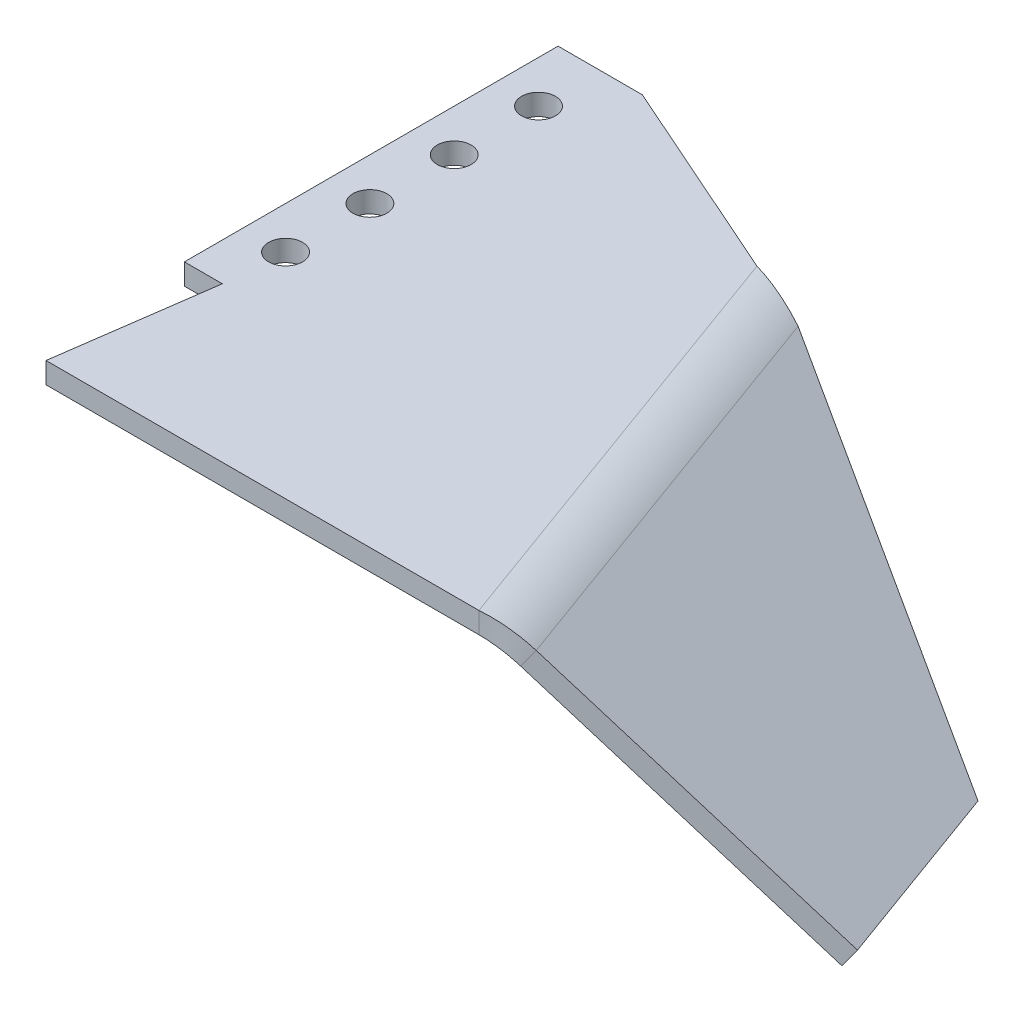
ISO-10303-21;
HEADER;
FILE_DESCRIPTION(('STEP AP214'),'2;1');
FILE_NAME('part.step','',(''),(''),'','','');
FILE_SCHEMA(('AUTOMOTIVE_DESIGN { 1 0 10303 214 1 1 1 1 }'));
ENDSEC;
DATA;
#1=APPLICATION_CONTEXT('core data for automotive mechanical design processes');
#2=APPLICATION_PROTOCOL_DEFINITION('international standard','automotive_design',2000,#1);
#3=PRODUCT_CONTEXT('',#1,'mechanical');
#4=PRODUCT('Part','Part','',(#3));
#5=PRODUCT_RELATED_PRODUCT_CATEGORY('part','',(#4));
#6=PRODUCT_DEFINITION_FORMATION('','',#4);
#7=PRODUCT_DEFINITION_CONTEXT('part definition',#1,'design');
#8=PRODUCT_DEFINITION('design','',#6,#7);
#9=PRODUCT_DEFINITION_SHAPE('','',#8);
#10=(LENGTH_UNIT() NAMED_UNIT(*) SI_UNIT(.MILLI.,.METRE.));
#11=(NAMED_UNIT(*) PLANE_ANGLE_UNIT() SI_UNIT($,.RADIAN.));
#12=(NAMED_UNIT(*) SI_UNIT($,.STERADIAN.) SOLID_ANGLE_UNIT());
#13=UNCERTAINTY_MEASURE_WITH_UNIT(LENGTH_MEASURE(1.E-05),#10,'distance_accuracy_value','');
#14=(GEOMETRIC_REPRESENTATION_CONTEXT(3) GLOBAL_UNCERTAINTY_ASSIGNED_CONTEXT((#13)) GLOBAL_UNIT_ASSIGNED_CONTEXT((#10,
#11,#12)) REPRESENTATION_CONTEXT('',''));
#15=CARTESIAN_POINT('',(0.,0.,0.));
#16=DIRECTION('',(0.,0.,1.));
#17=DIRECTION('',(1.,0.,0.));
#18=AXIS2_PLACEMENT_3D('',#15,#16,#17);
#19=CARTESIAN_POINT('',(86.3212998025083,-26.5217748538847,26.1180665960054));
#20=DIRECTION('',(-0.207730764031655,0.354974468036249,0.911504830879797));
#21=DIRECTION('',(0.816298053583275,-0.450536408494973,0.361489187025849));
#22=AXIS2_PLACEMENT_3D('',#19,#20,#21);
#23=PLANE('',#22);
#24=DIRECTION('',(-0.538985544695757,-0.819152044288991,0.19617469496901));
#25=VECTOR('',#24,1.);
#26=CARTESIAN_POINT('',(44.2655111862627,-3.31007677814735,7.49409368576421));
#27=LINE('',#26,#25);
#28=CARTESIAN_POINT('',(45.9767902906718,-0.709269037529801,6.87123902923758));
#29=VERTEX_POINT('',#28);
#30=CARTESIAN_POINT('',(44.2655111862627,-3.31007677814735,7.49409368576421));
#31=VERTEX_POINT('',#30);
#32=EDGE_CURVE('E11',#29,#31,#27,.T.);
#33=ORIENTED_EDGE('',*,*,#32,.F.);
#34=DIRECTION('',(0.816298053583275,-0.450536408494973,0.361489187025849));
#35=VECTOR('',#34,1.);
#36=CARTESIAN_POINT('',(88.0325789069173,-23.9209671132671,25.4952119394788));
#37=LINE('',#36,#35);
#38=CARTESIAN_POINT('',(94.6081225950128,-27.5501829666332,28.4071237486868));
#39=VERTEX_POINT('',#38);
#40=EDGE_CURVE('E105',#29,#39,#37,.T.);
#41=ORIENTED_EDGE('',*,*,#40,.T.);
#42=DIRECTION('',(-0.538985544695757,-0.819152044288991,0.19617469496901));
#43=VECTOR('',#42,1.);
#44=CARTESIAN_POINT('',(92.8968434906037,-30.1509907072508,29.0299784052133));
#45=LINE('',#44,#43);
#46=CARTESIAN_POINT('',(92.8968434906037,-30.1509907072508,29.0299784052133));
#47=VERTEX_POINT('',#46);
#48=EDGE_CURVE('E56',#39,#47,#45,.T.);
#49=ORIENTED_EDGE('',*,*,#48,.T.);
#50=DIRECTION('',(0.816298053583275,-0.450536408494973,0.361489187025849));
#51=VECTOR('',#50,1.);
#52=CARTESIAN_POINT('',(86.3212998025083,-26.5217748538847,26.1180665960054));
#53=LINE('',#52,#51);
#54=EDGE_CURVE('E108',#31,#47,#53,.T.);
#55=ORIENTED_EDGE('',*,*,#54,.F.);
#56=EDGE_LOOP('',(#33,#41,#49,#55));
#57=FACE_BOUND('',#56,.T.);
#58=ADVANCED_FACE('F45',(#57),#23,.F.);
#59=CARTESIAN_POINT('',(92.8968434906038,-30.1509907072508,29.0299784052133));
#60=DIRECTION('',(-0.769751131320058,0.573576436351047,0.280166499593233));
#61=DIRECTION('',(0.342020143325666,0.,0.93969262078591));
#62=AXIS2_PLACEMENT_3D('',#59,#60,#61);
#63=PLANE('',#62);
#64=ORIENTED_EDGE('',*,*,#48,.F.);
#65=DIRECTION('',(0.342020143325666,0.,0.93969262078591));
#66=VECTOR('',#65,1.);
#67=CARTESIAN_POINT('',(94.6081225950128,-27.5501829666332,28.4071237486867));
#68=LINE('',#67,#66);
#69=CARTESIAN_POINT('',(104.992448710341,-27.5501829666332,56.9378252668029));
#70=VERTEX_POINT('',#69);
#71=EDGE_CURVE('E134',#39,#70,#68,.T.);
#72=ORIENTED_EDGE('',*,*,#71,.T.);
#73=DIRECTION('',(-0.538985544695757,-0.819152044288991,0.19617469496901));
#74=VECTOR('',#73,1.);
#75=CARTESIAN_POINT('',(103.281169605932,-30.1509907072508,57.5606799233295));
#76=LINE('',#75,#74);
#77=CARTESIAN_POINT('',(103.281169605932,-30.1509907072508,57.5606799233295));
#78=VERTEX_POINT('',#77);
#79=EDGE_CURVE('E188',#70,#78,#76,.T.);
#80=ORIENTED_EDGE('',*,*,#79,.T.);
#81=DIRECTION('',(0.342020143325666,0.,0.93969262078591));
#82=VECTOR('',#81,1.);
#83=CARTESIAN_POINT('',(92.8968434906038,-30.1509907072508,29.0299784052133));
#84=LINE('',#83,#82);
#85=EDGE_CURVE('E201',#47,#78,#84,.T.);
#86=ORIENTED_EDGE('',*,*,#85,.F.);
#87=EDGE_LOOP('',(#64,#72,#80,#86));
#88=FACE_BOUND('',#87,.T.);
#89=ADVANCED_FACE('F208',(#88),#63,.F.);
#90=CARTESIAN_POINT('',(72.0975437886997,-7.18391408226765,67.7862812544511));
#91=DIRECTION('',(-0.321598313483679,-0.0151285657140216,-0.946755328088462));
#92=DIRECTION('',(-0.778504404209425,0.573376887253579,0.25528383769821));
#93=AXIS2_PLACEMENT_3D('',#90,#91,#92);
#94=PLANE('',#93);
#95=ORIENTED_EDGE('',*,*,#79,.F.);
#96=DIRECTION('',(-0.778504404209425,0.573376887253579,0.25528383769821));
#97=VECTOR('',#96,1.);
#98=CARTESIAN_POINT('',(73.8088228931087,-4.58310634165011,67.1634265979245));
#99=LINE('',#98,#97);
#100=CARTESIAN_POINT('',(68.5491072165774,-0.709269037529816,68.8881700879371));
#101=VERTEX_POINT('',#100);
#102=EDGE_CURVE('E276',#70,#101,#99,.T.);
#103=ORIENTED_EDGE('',*,*,#102,.T.);
#104=DIRECTION('',(-0.538985544695758,-0.819152044288991,0.19617469496901));
#105=VECTOR('',#104,1.);
#106=CARTESIAN_POINT('',(66.8378281121683,-3.31007677814736,69.5110247444637));
#107=LINE('',#106,#105);
#108=CARTESIAN_POINT('',(66.8378281121683,-3.31007677814736,69.5110247444637));
#109=VERTEX_POINT('',#108);
#110=EDGE_CURVE('E184',#101,#109,#107,.T.);
#111=ORIENTED_EDGE('',*,*,#110,.T.);
#112=DIRECTION('',(-0.778504404209425,0.573376887253579,0.25528383769821));
#113=VECTOR('',#112,1.);
#114=CARTESIAN_POINT('',(72.0975437886997,-7.18391408226765,67.7862812544511));
#115=LINE('',#114,#113);
#116=EDGE_CURVE('E210',#78,#109,#115,.T.);
#117=ORIENTED_EDGE('',*,*,#116,.F.);
#118=EDGE_LOOP('',(#95,#103,#111,#117));
#119=FACE_BOUND('',#118,.T.);
#120=ADVANCED_FACE('F294',(#119),#94,.F.);
#121=CARTESIAN_POINT('',(68.9760457963346,-1.04111096718413,68.738685480414));
#122=CARTESIAN_POINT('',(68.3701994548696,-1.88039338658545,68.9591955152464));
#123=CARTESIAN_POINT('',(67.7643531134046,-2.71967580598677,69.1797055500787));
#124=CARTESIAN_POINT('',(67.1585067719396,-3.55895822538809,69.4002155849111));
#125=CARTESIAN_POINT('',(50.0480258859322,14.432366075766,75.6279213213985));
#126=CARTESIAN_POINT('',(51.0195145370008,12.3036272361188,75.2743283694821));
#127=CARTESIAN_POINT('',(51.9910031880693,10.1748883964717,74.9207354175658));
#128=CARTESIAN_POINT('',(52.9624918391378,8.04614955682449,74.5671424656494));
#129=CARTESIAN_POINT('',(31.6149473667552,-5.71041198986575,70.2248745829254));
#130=CARTESIAN_POINT('',(33.7981287007537,-6.16058599071027,69.4302615613444));
#131=CARTESIAN_POINT('',(35.9813100347523,-6.6107599915548,68.6356485397634));
#132=CARTESIAN_POINT('',(38.1644913687508,-7.06093399239932,67.8410355181823));
#133=CARTESIAN_POINT('',(50.5429672771576,-21.1838890328159,63.335638741941));
#134=CARTESIAN_POINT('',(51.1488136186226,-20.3446066134145,63.1151287071087));
#135=CARTESIAN_POINT('',(51.7546599600876,-19.5053241940132,62.8946186722763));
#136=CARTESIAN_POINT('',(52.3605063015526,-18.6660417746119,62.674108637444));
#137=CARTESIAN_POINT('',(69.47098718756,-36.657366075766,56.4464029009565));
#138=CARTESIAN_POINT('',(68.4994985364915,-34.5286272361188,56.7999958528729));
#139=CARTESIAN_POINT('',(67.528009885423,-32.3998883964717,57.1535888047893));
#140=CARTESIAN_POINT('',(66.5565212343544,-30.2711495568245,57.5071817567056));
#141=CARTESIAN_POINT('',(87.9040657067371,-16.5145880101343,61.8494496394296));
#142=CARTESIAN_POINT('',(85.7208843727385,-16.0644140092897,62.6440626610106));
#143=CARTESIAN_POINT('',(83.53770303874,-15.6142400084452,63.4386756825917));
#144=CARTESIAN_POINT('',(81.3545217047414,-15.1640660076007,64.2332887041727));
#145=CARTESIAN_POINT('',(68.9760457963346,-1.04111096718413,68.738685480414));
#146=CARTESIAN_POINT('',(68.3701994548696,-1.88039338658545,68.9591955152464));
#147=CARTESIAN_POINT('',(67.7643531134046,-2.71967580598677,69.1797055500787));
#148=CARTESIAN_POINT('',(67.1585067719396,-3.55895822538809,69.4002155849111));
#149=(BOUNDED_SURFACE() B_SPLINE_SURFACE(3,3,((#121,#122,#123,#124),(#125,#126,#127,#128),(#129,
#130,#131,#132),(#133,#134,#135,#136),(#137,#138,#139,#140),(#141,#142,#143,#144),(#145,#146,
#147,#148)),.UNSPECIFIED.,.T.,.F.,.F.) B_SPLINE_SURFACE_WITH_KNOTS((4,3,4),(4,4),(0.,0.5,1.),
(0.,1.),.UNSPECIFIED.) GEOMETRIC_REPRESENTATION_ITEM() RATIONAL_B_SPLINE_SURFACE(((1.,1.,1.,1.),
(0.333333333333333,0.333333333333333,0.333333333333333,0.333333333333333),(0.333333333333333,
0.333333333333333,0.333333333333333,0.333333333333333),(1.,1.,1.,1.),(0.333333333333333,
0.333333333333333,0.333333333333333,0.333333333333333),(0.333333333333333,0.333333333333333,
0.333333333333333,0.333333333333333),(1.,1.,1.,1.))) REPRESENTATION_ITEM('') SURFACE());
#150=CARTESIAN_POINT('',(59.7595065367461,-11.1125,66.0371621111775));
#151=DIRECTION('',(-0.0780293241779053,0.3242834139524,-0.9427362791384));
#152=DIRECTION('',(0.662262720111887,0.723688719628526,0.194120392108684));
#153=AXIS2_PLACEMENT_3D('',#150,#151,#152);
#154=ELLIPSE('',#153,13.9167417698394,12.7);
#155=CARTESIAN_POINT('',(61.3030326809593,1.5875,70.2779653387413));
#156=VERTEX_POINT('',#155);
#157=EDGE_CURVE('E123',#101,#156,#154,.F.);
#158=DIRECTION('',(0.,-1.,0.));
#159=VECTOR('',#158,1.);
#160=CARTESIAN_POINT('',(61.3030326809593,-1.5875,70.2779653387413));
#161=LINE('',#160,#159);
#162=CARTESIAN_POINT('',(61.3030326809593,-1.5875,70.2779653387413));
#163=VERTEX_POINT('',#162);
#164=EDGE_CURVE('E64',#156,#163,#161,.T.);
#165=CARTESIAN_POINT('',(59.7595065367461,-11.1125,66.0371621111775));
#166=DIRECTION('',(0.,0.406736643075798,-0.913545457642602));
#167=DIRECTION('',(0.666843674245813,0.680771913831372,0.303099184190116));
#168=AXIS2_PLACEMENT_3D('',#165,#166,#167);
#169=ELLIPSE('',#168,11.0955543569662,9.525);
#170=EDGE_CURVE('E206',#109,#163,#169,.F.);
#171=ORIENTED_EDGE('',*,*,#110,.F.);
#172=ORIENTED_EDGE('',*,*,#157,.T.);
#173=ORIENTED_EDGE('',*,*,#164,.T.);
#174=ORIENTED_EDGE('',*,*,#170,.F.);
#175=EDGE_LOOP('',(#171,#172,#173,#174));
#176=FACE_BOUND('',#175,.T.);
#177=ADVANCED_FACE('F297',(#176),#149,.T.);
#178=CARTESIAN_POINT('',(0.,-1.5875,70.2779653387413));
#179=DIRECTION('',(0.,0.,-1.));
#180=DIRECTION('',(-1.,0.,0.));
#181=AXIS2_PLACEMENT_3D('',#178,#179,#180);
#182=PLANE('',#181);
#183=ORIENTED_EDGE('',*,*,#164,.F.);
#184=DIRECTION('',(1.,0.,0.));
#185=VECTOR('',#184,1.);
#186=CARTESIAN_POINT('',(0.,1.5875,70.2779653387413));
#187=LINE('',#186,#185);
#188=CARTESIAN_POINT('',(-3.90791008722715,1.5875,70.2779653387413));
#189=VERTEX_POINT('',#188);
#190=EDGE_CURVE('E271',#156,#189,#187,.F.);
#191=ORIENTED_EDGE('',*,*,#190,.T.);
#192=DIRECTION('',(0.,-1.,0.));
#193=VECTOR('',#192,1.);
#194=CARTESIAN_POINT('',(-3.90791008722715,-1.5875,70.2779653387413));
#195=LINE('',#194,#193);
#196=CARTESIAN_POINT('',(-3.90791008722715,-1.5875,70.2779653387413));
#197=VERTEX_POINT('',#196);
#198=EDGE_CURVE('E178',#189,#197,#195,.T.);
#199=ORIENTED_EDGE('',*,*,#198,.T.);
#200=DIRECTION('',(-1.,0.,0.));
#201=VECTOR('',#200,1.);
#202=CARTESIAN_POINT('',(0.,-1.5875,70.2779653387413));
#203=LINE('',#202,#201);
#204=EDGE_CURVE('E223',#163,#197,#203,.T.);
#205=ORIENTED_EDGE('',*,*,#204,.F.);
#206=EDGE_LOOP('',(#183,#191,#199,#205));
#207=FACE_BOUND('',#206,.T.);
#208=ADVANCED_FACE('F333',(#207),#182,.F.);
#209=CARTESIAN_POINT('',(-5.56123733798836,-1.58750000000001,82.042));
#210=DIRECTION('',(0.99026806874157,0.,0.139173100960069));
#211=DIRECTION('',(0.139173100960069,0.,-0.99026806874157));
#212=AXIS2_PLACEMENT_3D('',#209,#210,#211);
#213=PLANE('',#212);
#214=ORIENTED_EDGE('',*,*,#198,.F.);
#215=DIRECTION('',(0.139173100960069,0.,-0.99026806874157));
#216=VECTOR('',#215,1.);
#217=CARTESIAN_POINT('',(-5.56123733798836,1.58749999999999,82.042));
#218=LINE('',#217,#216);
#219=CARTESIAN_POINT('',(-0.635000000000001,1.5875,46.99));
#220=VERTEX_POINT('',#219);
#221=EDGE_CURVE('E284',#189,#220,#218,.T.);
#222=ORIENTED_EDGE('',*,*,#221,.T.);
#223=DIRECTION('',(0.,-1.,0.));
#224=VECTOR('',#223,1.);
#225=CARTESIAN_POINT('',(-0.635000000000001,-1.5875,46.99));
#226=LINE('',#225,#224);
#227=CARTESIAN_POINT('',(-0.635000000000001,-1.5875,46.99));
#228=VERTEX_POINT('',#227);
#229=EDGE_CURVE('E174',#220,#228,#226,.T.);
#230=ORIENTED_EDGE('',*,*,#229,.T.);
#231=DIRECTION('',(0.139173100960069,0.,-0.99026806874157));
#232=VECTOR('',#231,1.);
#233=CARTESIAN_POINT('',(-5.56123733798836,-1.58750000000001,82.042));
#234=LINE('',#233,#232);
#235=EDGE_CURVE('E227',#197,#228,#234,.T.);
#236=ORIENTED_EDGE('',*,*,#235,.F.);
#237=EDGE_LOOP('',(#214,#222,#230,#236));
#238=FACE_BOUND('',#237,.T.);
#239=ADVANCED_FACE('F336',(#238),#213,.F.);
#240=CARTESIAN_POINT('',(-6.35,-1.5875,46.99));
#241=DIRECTION('',(0.,0.,1.));
#242=DIRECTION('',(1.,0.,0.));
#243=AXIS2_PLACEMENT_3D('',#240,#241,#242);
#244=PLANE('',#243);
#245=ORIENTED_EDGE('',*,*,#229,.F.);
#246=DIRECTION('',(1.,0.,0.));
#247=VECTOR('',#246,1.);
#248=CARTESIAN_POINT('',(0.,1.5875,46.99));
#249=LINE('',#248,#247);
#250=CARTESIAN_POINT('',(-6.35,1.5875,46.99));
#251=VERTEX_POINT('',#250);
#252=EDGE_CURVE('E280',#251,#220,#249,.T.);
#253=ORIENTED_EDGE('',*,*,#252,.F.);
#254=DIRECTION('',(0.,-1.,0.));
#255=VECTOR('',#254,1.);
#256=CARTESIAN_POINT('',(-6.35,-1.5875,46.99));
#257=LINE('',#256,#255);
#258=CARTESIAN_POINT('',(-6.35,-1.5875,46.99));
#259=VERTEX_POINT('',#258);
#260=EDGE_CURVE('E170',#251,#259,#257,.T.);
#261=ORIENTED_EDGE('',*,*,#260,.T.);
#262=DIRECTION('',(1.,0.,0.));
#263=VECTOR('',#262,1.);
#264=CARTESIAN_POINT('',(-6.35,-1.5875,46.99));
#265=LINE('',#264,#263);
#266=EDGE_CURVE('E231',#259,#228,#265,.T.);
#267=ORIENTED_EDGE('',*,*,#266,.T.);
#268=EDGE_LOOP('',(#245,#253,#261,#267));
#269=FACE_BOUND('',#268,.T.);
#270=ADVANCED_FACE('F339',(#269),#244,.T.);
#271=CARTESIAN_POINT('',(-6.35,-1.5875,-9.2964));
#272=DIRECTION('',(-1.,0.,0.));
#273=DIRECTION('',(0.,0.,1.));
#274=AXIS2_PLACEMENT_3D('',#271,#272,#273);
#275=PLANE('',#274);
#276=ORIENTED_EDGE('',*,*,#260,.F.);
#277=DIRECTION('',(0.,0.,1.));
#278=VECTOR('',#277,1.);
#279=CARTESIAN_POINT('',(-6.35,1.5875,0.));
#280=LINE('',#279,#278);
#281=CARTESIAN_POINT('',(-6.35,1.5875,-9.2964));
#282=VERTEX_POINT('',#281);
#283=EDGE_CURVE('E151',#282,#251,#280,.T.);
#284=ORIENTED_EDGE('',*,*,#283,.F.);
#285=DIRECTION('',(0.,-1.,0.));
#286=VECTOR('',#285,1.);
#287=CARTESIAN_POINT('',(-6.35,-1.5875,-9.2964));
#288=LINE('',#287,#286);
#289=CARTESIAN_POINT('',(-6.35,-1.5875,-9.2964));
#290=VERTEX_POINT('',#289);
#291=EDGE_CURVE('E166',#282,#290,#288,.T.);
#292=ORIENTED_EDGE('',*,*,#291,.T.);
#293=DIRECTION('',(0.,0.,1.));
#294=VECTOR('',#293,1.);
#295=CARTESIAN_POINT('',(-6.35,-1.5875,-9.2964));
#296=LINE('',#295,#294);
#297=EDGE_CURVE('E235',#290,#259,#296,.T.);
#298=ORIENTED_EDGE('',*,*,#297,.T.);
#299=EDGE_LOOP('',(#276,#284,#292,#298));
#300=FACE_BOUND('',#299,.T.);
#301=ADVANCED_FACE('F341',(#300),#275,.T.);
#302=CARTESIAN_POINT('',(-6.35,-1.5875,-9.2964));
#303=DIRECTION('',(0.,0.,-1.));
#304=DIRECTION('',(-1.,0.,0.));
#305=AXIS2_PLACEMENT_3D('',#302,#303,#304);
#306=PLANE('',#305);
#307=ORIENTED_EDGE('',*,*,#291,.F.);
#308=DIRECTION('',(1.,0.,0.));
#309=VECTOR('',#308,1.);
#310=CARTESIAN_POINT('',(0.,1.5875,-9.2964));
#311=LINE('',#310,#309);
#312=CARTESIAN_POINT('',(6.35000000000002,1.5875,-9.2964));
#313=VERTEX_POINT('',#312);
#314=EDGE_CURVE('E272',#313,#282,#311,.F.);
#315=ORIENTED_EDGE('',*,*,#314,.F.);
#316=DIRECTION('',(0.,-1.,0.));
#317=VECTOR('',#316,1.);
#318=CARTESIAN_POINT('',(6.35000000000002,-1.58749999999999,-9.2964));
#319=LINE('',#318,#317);
#320=CARTESIAN_POINT('',(6.35000000000002,-1.58749999999999,-9.2964));
#321=VERTEX_POINT('',#320);
#322=EDGE_CURVE('E162',#313,#321,#319,.T.);
#323=ORIENTED_EDGE('',*,*,#322,.T.);
#324=DIRECTION('',(-1.,0.,0.));
#325=VECTOR('',#324,1.);
#326=CARTESIAN_POINT('',(-6.35,-1.5875,-9.2964));
#327=LINE('',#326,#325);
#328=EDGE_CURVE('E213',#321,#290,#327,.T.);
#329=ORIENTED_EDGE('',*,*,#328,.T.);
#330=EDGE_LOOP('',(#307,#315,#323,#329));
#331=FACE_BOUND('',#330,.T.);
#332=ADVANCED_FACE('F315',(#331),#306,.T.);
#333=CARTESIAN_POINT('',(4.48295550642454,-1.5875,-10.1232014276906));
#334=DIRECTION('',(-0.404912826083848,0.,0.914355293785075));
#335=DIRECTION('',(0.914355293785076,0.,0.404912826083848));
#336=AXIS2_PLACEMENT_3D('',#333,#334,#335);
#337=PLANE('',#336);
#338=ORIENTED_EDGE('',*,*,#322,.F.);
#339=DIRECTION('',(0.914355293785076,0.,0.404912826083848));
#340=VECTOR('',#339,1.);
#341=CARTESIAN_POINT('',(4.48295550642454,1.5875,-10.1232014276906));
#342=LINE('',#341,#340);
#343=CARTESIAN_POINT('',(37.334414839175,1.5875,4.42472904290097));
#344=VERTEX_POINT('',#343);
#345=EDGE_CURVE('E268',#313,#344,#342,.T.);
#346=ORIENTED_EDGE('',*,*,#345,.T.);
#347=DIRECTION('',(0.,-1.,0.));
#348=VECTOR('',#347,1.);
#349=CARTESIAN_POINT('',(37.334414839175,-1.5875,4.42472904290097));
#350=LINE('',#349,#348);
#351=CARTESIAN_POINT('',(37.334414839175,-1.5875,4.42472904290097));
#352=VERTEX_POINT('',#351);
#353=EDGE_CURVE('E49',#344,#352,#350,.T.);
#354=ORIENTED_EDGE('',*,*,#353,.T.);
#355=DIRECTION('',(0.914355293785076,0.,0.404912826083848));
#356=VECTOR('',#355,1.);
#357=CARTESIAN_POINT('',(4.48295550642454,-1.5875,-10.1232014276906));
#358=LINE('',#357,#356);
#359=EDGE_CURVE('E219',#321,#352,#358,.T.);
#360=ORIENTED_EDGE('',*,*,#359,.F.);
#361=EDGE_LOOP('',(#338,#346,#354,#360));
#362=FACE_BOUND('',#361,.T.);
#363=ADVANCED_FACE('F324',(#362),#337,.F.);
#364=CARTESIAN_POINT('',(52.4019366266415,-11.1125,8.69008903903458));
#365=CARTESIAN_POINT('',(51.4074286029764,-11.1125,9.05206035738758));
#366=CARTESIAN_POINT('',(50.4129205793113,-11.1125,9.41403167574058));
#367=CARTESIAN_POINT('',(49.4184125556462,-11.1125,9.77600299409357));
#368=CARTESIAN_POINT('',(52.4019366266415,-36.5125,8.69008903903458));
#369=CARTESIAN_POINT('',(51.4074286029764,-34.3958333333333,9.05206035738758));
#370=CARTESIAN_POINT('',(50.4129205793113,-32.2791666666667,9.41403167574058));
#371=CARTESIAN_POINT('',(49.4184125556462,-30.1625,9.77600299409357));
#372=CARTESIAN_POINT('',(22.2668930517085,-36.5125,0.159369046767371));
#373=CARTESIAN_POINT('',(23.2614010753736,-34.3958333333333,-0.202602271585626));
#374=CARTESIAN_POINT('',(24.2559090990387,-32.2791666666667,-0.564573589938623));
#375=CARTESIAN_POINT('',(25.2504171227038,-30.1625,-0.92654490829162));
#376=CARTESIAN_POINT('',(22.2668930517085,-11.1125,0.159369046767372));
#377=CARTESIAN_POINT('',(23.2614010753736,-11.1125,-0.202602271585625));
#378=CARTESIAN_POINT('',(24.2559090990387,-11.1125,-0.564573589938622));
#379=CARTESIAN_POINT('',(25.2504171227038,-11.1125,-0.926544908291619));
#380=CARTESIAN_POINT('',(22.2668930517085,14.2875,0.159369046767374));
#381=CARTESIAN_POINT('',(23.2614010753736,12.1708333333333,-0.202602271585623));
#382=CARTESIAN_POINT('',(24.2559090990387,10.0541666666667,-0.564573589938621));
#383=CARTESIAN_POINT('',(25.2504171227038,7.9375,-0.926544908291617));
#384=CARTESIAN_POINT('',(52.4019366266415,14.2875,8.69008903903458));
#385=CARTESIAN_POINT('',(51.4074286029764,12.1708333333333,9.05206035738758));
#386=CARTESIAN_POINT('',(50.4129205793113,10.0541666666667,9.41403167574058));
#387=CARTESIAN_POINT('',(49.4184125556462,7.93749999999999,9.77600299409357));
#388=CARTESIAN_POINT('',(52.4019366266415,-11.1125,8.69008903903458));
#389=CARTESIAN_POINT('',(51.4074286029764,-11.1125,9.05206035738758));
#390=CARTESIAN_POINT('',(50.4129205793113,-11.1125,9.41403167574058));
#391=CARTESIAN_POINT('',(49.4184125556462,-11.1125,9.77600299409357));
#392=(BOUNDED_SURFACE() B_SPLINE_SURFACE(3,3,((#364,#365,#366,#367),(#368,#369,#370,#371),(#372,
#373,#374,#375),(#376,#377,#378,#379),(#380,#381,#382,#383),(#384,#385,#386,#387),(#388,#389,
#390,#391)),.UNSPECIFIED.,.T.,.F.,.F.) B_SPLINE_SURFACE_WITH_KNOTS((4,3,4),(4,4),(0.,0.5,1.),
(0.,1.),.UNSPECIFIED.) GEOMETRIC_REPRESENTATION_ITEM() RATIONAL_B_SPLINE_SURFACE(((1.,1.,1.,1.),
(0.333333333333333,0.333333333333333,0.333333333333333,0.333333333333333),(0.333333333333333,
0.333333333333333,0.333333333333333,0.333333333333333),(1.,1.,1.,1.),(0.333333333333333,
0.333333333333333,0.333333333333333,0.333333333333333),(0.333333333333333,0.333333333333333,
0.333333333333333,0.333333333333333),(1.,1.,1.,1.))) REPRESENTATION_ITEM('') SURFACE());
#393=CARTESIAN_POINT('',(37.334414839175,-11.1125,4.42472904290098));
#394=DIRECTION('',(-0.272379639293923,0.,0.962189862811967));
#395=DIRECTION('',(0.962189862811967,0.,0.272379639293923));
#396=AXIS2_PLACEMENT_3D('',#393,#394,#395);
#397=ELLIPSE('',#396,15.6596139388043,12.7);
#398=EDGE_CURVE('E121',#344,#29,#397,.F.);
#399=CARTESIAN_POINT('',(37.334414839175,-11.1125,4.42472904290098));
#400=DIRECTION('',(-0.404912826083848,0.,0.914355293785076));
#401=DIRECTION('',(0.914355293785076,0.,0.404912826083848));
#402=AXIS2_PLACEMENT_3D('',#399,#400,#401);
#403=ELLIPSE('',#402,13.2158667408685,9.525);
#404=EDGE_CURVE('E261',#352,#31,#403,.F.);
#405=ORIENTED_EDGE('',*,*,#398,.T.);
#406=ORIENTED_EDGE('',*,*,#32,.T.);
#407=ORIENTED_EDGE('',*,*,#404,.F.);
#408=ORIENTED_EDGE('',*,*,#353,.F.);
#409=EDGE_LOOP('',(#405,#406,#407,#408));
#410=FACE_BOUND('',#409,.T.);
#411=ADVANCED_FACE('F138',(#410),#392,.T.);
#412=CARTESIAN_POINT('',(0.,-1.5875,0.));
#413=DIRECTION('',(0.,1.,0.));
#414=DIRECTION('',(0.,0.,1.));
#415=AXIS2_PLACEMENT_3D('',#412,#413,#414);
#416=CYLINDRICAL_SURFACE('',#415,2.5527);
#417=CARTESIAN_POINT('',(0.,-1.5875,0.));
#418=DIRECTION('',(0.,1.,0.));
#419=DIRECTION('',(0.,0.,1.));
#420=AXIS2_PLACEMENT_3D('',#417,#418,#419);
#421=CIRCLE('',#420,2.5527);
#422=CARTESIAN_POINT('',(0.,-1.5875,2.5527));
#423=VERTEX_POINT('',#422);
#424=EDGE_CURVE('E239',#423,#423,#421,.T.);
#425=ORIENTED_EDGE('',*,*,#424,.F.);
#426=EDGE_LOOP('',(#425));
#427=FACE_BOUND('',#426,.T.);
#428=CARTESIAN_POINT('',(0.,1.5875,0.));
#429=DIRECTION('',(0.,1.,0.));
#430=DIRECTION('',(0.,0.,1.));
#431=AXIS2_PLACEMENT_3D('',#428,#429,#430);
#432=CIRCLE('',#431,2.5527);
#433=CARTESIAN_POINT('',(0.,1.5875,2.5527));
#434=VERTEX_POINT('',#433);
#435=EDGE_CURVE('E146',#434,#434,#432,.T.);
#436=ORIENTED_EDGE('',*,*,#435,.T.);
#437=EDGE_LOOP('',(#436));
#438=FACE_BOUND('',#437,.T.);
#439=ADVANCED_FACE('F362',(#427,#438),#416,.F.);
#440=CARTESIAN_POINT('',(0.,-1.5875,12.7));
#441=DIRECTION('',(0.,1.,0.));
#442=DIRECTION('',(0.,0.,1.));
#443=AXIS2_PLACEMENT_3D('',#440,#441,#442);
#444=CYLINDRICAL_SURFACE('',#443,2.5527);
#445=CARTESIAN_POINT('',(0.,-1.5875,12.7));
#446=DIRECTION('',(0.,1.,0.));
#447=DIRECTION('',(0.,0.,1.));
#448=AXIS2_PLACEMENT_3D('',#445,#446,#447);
#449=CIRCLE('',#448,2.5527);
#450=CARTESIAN_POINT('',(0.,-1.5875,15.2527));
#451=VERTEX_POINT('',#450);
#452=EDGE_CURVE('E243',#451,#451,#449,.T.);
#453=ORIENTED_EDGE('',*,*,#452,.F.);
#454=EDGE_LOOP('',(#453));
#455=FACE_BOUND('',#454,.T.);
#456=CARTESIAN_POINT('',(0.,1.5875,12.7));
#457=DIRECTION('',(0.,1.,0.));
#458=DIRECTION('',(0.,0.,1.));
#459=AXIS2_PLACEMENT_3D('',#456,#457,#458);
#460=CIRCLE('',#459,2.5527);
#461=CARTESIAN_POINT('',(0.,1.5875,15.2527));
#462=VERTEX_POINT('',#461);
#463=EDGE_CURVE('E150',#462,#462,#460,.T.);
#464=ORIENTED_EDGE('',*,*,#463,.T.);
#465=EDGE_LOOP('',(#464));
#466=FACE_BOUND('',#465,.T.);
#467=ADVANCED_FACE('F370',(#455,#466),#444,.F.);
#468=CARTESIAN_POINT('',(0.,-1.5875,25.4));
#469=DIRECTION('',(0.,1.,0.));
#470=DIRECTION('',(0.,0.,1.));
#471=AXIS2_PLACEMENT_3D('',#468,#469,#470);
#472=CYLINDRICAL_SURFACE('',#471,2.5527);
#473=CARTESIAN_POINT('',(0.,-1.5875,25.4));
#474=DIRECTION('',(0.,1.,0.));
#475=DIRECTION('',(0.,0.,1.));
#476=AXIS2_PLACEMENT_3D('',#473,#474,#475);
#477=CIRCLE('',#476,2.5527);
#478=CARTESIAN_POINT('',(0.,-1.5875,27.9527));
#479=VERTEX_POINT('',#478);
#480=EDGE_CURVE('E247',#479,#479,#477,.T.);
#481=ORIENTED_EDGE('',*,*,#480,.F.);
#482=EDGE_LOOP('',(#481));
#483=FACE_BOUND('',#482,.T.);
#484=CARTESIAN_POINT('',(0.,1.5875,25.4));
#485=DIRECTION('',(0.,1.,0.));
#486=DIRECTION('',(0.,0.,1.));
#487=AXIS2_PLACEMENT_3D('',#484,#485,#486);
#488=CIRCLE('',#487,2.5527);
#489=CARTESIAN_POINT('',(0.,1.5875,27.9527));
#490=VERTEX_POINT('',#489);
#491=EDGE_CURVE('E155',#490,#490,#488,.T.);
#492=ORIENTED_EDGE('',*,*,#491,.T.);
#493=EDGE_LOOP('',(#492));
#494=FACE_BOUND('',#493,.T.);
#495=ADVANCED_FACE('F373',(#483,#494),#472,.F.);
#496=CARTESIAN_POINT('',(0.,-1.5875,38.1));
#497=DIRECTION('',(0.,1.,0.));
#498=DIRECTION('',(0.,0.,1.));
#499=AXIS2_PLACEMENT_3D('',#496,#497,#498);
#500=CYLINDRICAL_SURFACE('',#499,2.5527);
#501=CARTESIAN_POINT('',(0.,-1.5875,38.1));
#502=DIRECTION('',(0.,1.,0.));
#503=DIRECTION('',(0.,0.,1.));
#504=AXIS2_PLACEMENT_3D('',#501,#502,#503);
#505=CIRCLE('',#504,2.5527);
#506=CARTESIAN_POINT('',(0.,-1.5875,40.6527));
#507=VERTEX_POINT('',#506);
#508=EDGE_CURVE('E251',#507,#507,#505,.T.);
#509=ORIENTED_EDGE('',*,*,#508,.F.);
#510=EDGE_LOOP('',(#509));
#511=FACE_BOUND('',#510,.T.);
#512=CARTESIAN_POINT('',(0.,1.5875,38.1));
#513=DIRECTION('',(0.,1.,0.));
#514=DIRECTION('',(0.,0.,1.));
#515=AXIS2_PLACEMENT_3D('',#512,#513,#514);
#516=CIRCLE('',#515,2.5527);
#517=CARTESIAN_POINT('',(0.,1.5875,40.6527));
#518=VERTEX_POINT('',#517);
#519=EDGE_CURVE('E129',#518,#518,#516,.T.);
#520=ORIENTED_EDGE('',*,*,#519,.T.);
#521=EDGE_LOOP('',(#520));
#522=FACE_BOUND('',#521,.T.);
#523=ADVANCED_FACE('F47',(#511,#522),#500,.F.);
#524=CARTESIAN_POINT('',(0.,-1.5875,0.));
#525=DIRECTION('',(0.,1.,0.));
#526=DIRECTION('',(0.,0.,1.));
#527=AXIS2_PLACEMENT_3D('',#524,#525,#526);
#528=PLANE('',#527);
#529=ORIENTED_EDGE('',*,*,#359,.T.);
#530=DIRECTION('',(-0.342020143325666,0.,-0.939692620785909));
#531=VECTOR('',#530,1.);
#532=CARTESIAN_POINT('',(61.6768890982305,-1.5875,71.305127403312));
#533=LINE('',#532,#531);
#534=EDGE_CURVE('E257',#352,#163,#533,.F.);
#535=ORIENTED_EDGE('',*,*,#534,.T.);
#536=ORIENTED_EDGE('',*,*,#204,.T.);
#537=ORIENTED_EDGE('',*,*,#235,.T.);
#538=ORIENTED_EDGE('',*,*,#266,.F.);
#539=ORIENTED_EDGE('',*,*,#297,.F.);
#540=ORIENTED_EDGE('',*,*,#328,.F.);
#541=EDGE_LOOP('',(#529,#535,#536,#537,#538,#539,#540));
#542=FACE_BOUND('',#541,.T.);
#543=ORIENTED_EDGE('',*,*,#424,.T.);
#544=EDGE_LOOP('',(#543));
#545=FACE_BOUND('',#544,.T.);
#546=ORIENTED_EDGE('',*,*,#452,.T.);
#547=EDGE_LOOP('',(#546));
#548=FACE_BOUND('',#547,.T.);
#549=ORIENTED_EDGE('',*,*,#480,.T.);
#550=EDGE_LOOP('',(#549));
#551=FACE_BOUND('',#550,.T.);
#552=ORIENTED_EDGE('',*,*,#508,.T.);
#553=EDGE_LOOP('',(#552));
#554=FACE_BOUND('',#553,.T.);
#555=ADVANCED_FACE('F321',(#542,#545,#548,#551,#554),#528,.F.);
#556=CARTESIAN_POINT('',(74.9269105843091,-7.05081555624376,76.1156722261975));
#557=DIRECTION('',(0.538985544695757,0.819152044288991,-0.19617469496901));
#558=DIRECTION('',(-0.83538443099053,0.549666128171118,0.));
#559=AXIS2_PLACEMENT_3D('',#556,#557,#558);
#560=PLANE('',#559);
#561=ORIENTED_EDGE('',*,*,#116,.T.);
#562=DIRECTION('',(-0.342020143325666,0.,-0.93969262078591));
#563=VECTOR('',#562,1.);
#564=CARTESIAN_POINT('',(43.4562174186936,-3.31007677814736,5.27057733366256));
#565=LINE('',#564,#563);
#566=EDGE_CURVE('E204',#109,#31,#565,.T.);
#567=ORIENTED_EDGE('',*,*,#566,.T.);
#568=ORIENTED_EDGE('',*,*,#54,.T.);
#569=ORIENTED_EDGE('',*,*,#85,.T.);
#570=EDGE_LOOP('',(#561,#567,#568,#569));
#571=FACE_BOUND('',#570,.T.);
#572=ADVANCED_FACE('F200',(#571),#560,.F.);
#573=CARTESIAN_POINT('',(64.7729264799572,-11.1125,79.8114201993937));
#574=DIRECTION('',(0.342020143325666,0.,0.939692620785909));
#575=DIRECTION('',(0.939692620785909,0.,-0.342020143325666));
#576=AXIS2_PLACEMENT_3D('',#573,#574,#575);
#577=CYLINDRICAL_SURFACE('',#576,9.525);
#578=ORIENTED_EDGE('',*,*,#170,.T.);
#579=ORIENTED_EDGE('',*,*,#534,.F.);
#580=ORIENTED_EDGE('',*,*,#404,.T.);
#581=ORIENTED_EDGE('',*,*,#566,.F.);
#582=EDGE_LOOP('',(#578,#579,#580,#581));
#583=FACE_BOUND('',#582,.T.);
#584=ADVANCED_FACE('F301',(#583),#577,.F.);
#585=CARTESIAN_POINT('',(0.,1.5875,0.));
#586=DIRECTION('',(0.,1.,0.));
#587=DIRECTION('',(0.,0.,1.));
#588=AXIS2_PLACEMENT_3D('',#585,#586,#587);
#589=PLANE('',#588);
#590=ORIENTED_EDGE('',*,*,#345,.F.);
#591=ORIENTED_EDGE('',*,*,#314,.T.);
#592=ORIENTED_EDGE('',*,*,#283,.T.);
#593=ORIENTED_EDGE('',*,*,#252,.T.);
#594=ORIENTED_EDGE('',*,*,#221,.F.);
#595=ORIENTED_EDGE('',*,*,#190,.F.);
#596=DIRECTION('',(0.342020143325666,0.,0.939692620785909));
#597=VECTOR('',#596,1.);
#598=CARTESIAN_POINT('',(64.7729264799572,1.5875,79.8114201993937));
#599=LINE('',#598,#597);
#600=EDGE_CURVE('E128',#344,#156,#599,.T.);
#601=ORIENTED_EDGE('',*,*,#600,.F.);
#602=EDGE_LOOP('',(#590,#591,#592,#593,#594,#595,#601));
#603=FACE_BOUND('',#602,.T.);
#604=ORIENTED_EDGE('',*,*,#435,.F.);
#605=EDGE_LOOP('',(#604));
#606=FACE_BOUND('',#605,.T.);
#607=ORIENTED_EDGE('',*,*,#463,.F.);
#608=EDGE_LOOP('',(#607));
#609=FACE_BOUND('',#608,.T.);
#610=ORIENTED_EDGE('',*,*,#491,.F.);
#611=EDGE_LOOP('',(#610));
#612=FACE_BOUND('',#611,.T.);
#613=ORIENTED_EDGE('',*,*,#519,.F.);
#614=EDGE_LOOP('',(#613));
#615=FACE_BOUND('',#614,.T.);
#616=ADVANCED_FACE('F327',(#603,#606,#609,#612,#615),#589,.T.);
#617=CARTESIAN_POINT('',(76.6381896887182,-4.45000781562621,75.4928175696709));
#618=DIRECTION('',(0.538985544695757,0.819152044288991,-0.19617469496901));
#619=DIRECTION('',(-0.83538443099053,0.549666128171118,0.));
#620=AXIS2_PLACEMENT_3D('',#617,#618,#619);
#621=PLANE('',#620);
#622=ORIENTED_EDGE('',*,*,#102,.F.);
#623=ORIENTED_EDGE('',*,*,#71,.F.);
#624=ORIENTED_EDGE('',*,*,#40,.F.);
#625=DIRECTION('',(0.342020143325666,0.,0.939692620785909));
#626=VECTOR('',#625,1.);
#627=CARTESIAN_POINT('',(71.6180428975934,-0.709269037529809,77.3200015732873));
#628=LINE('',#627,#626);
#629=EDGE_CURVE('E118',#101,#29,#628,.F.);
#630=ORIENTED_EDGE('',*,*,#629,.F.);
#631=EDGE_LOOP('',(#622,#623,#624,#630));
#632=FACE_BOUND('',#631,.T.);
#633=ADVANCED_FACE('F132',(#632),#621,.T.);
#634=CARTESIAN_POINT('',(64.7729264799572,-11.1125,79.8114201993937));
#635=DIRECTION('',(0.342020143325666,0.,0.939692620785909));
#636=DIRECTION('',(0.939692620785909,0.,-0.342020143325666));
#637=AXIS2_PLACEMENT_3D('',#634,#635,#636);
#638=CYLINDRICAL_SURFACE('',#637,12.7);
#639=ORIENTED_EDGE('',*,*,#157,.F.);
#640=ORIENTED_EDGE('',*,*,#629,.T.);
#641=ORIENTED_EDGE('',*,*,#398,.F.);
#642=ORIENTED_EDGE('',*,*,#600,.T.);
#643=EDGE_LOOP('',(#639,#640,#641,#642));
#644=FACE_BOUND('',#643,.T.);
#645=ADVANCED_FACE('F119',(#644),#638,.T.);
#646=CLOSED_SHELL('',(#58,#89,#120,#177,#208,#239,#270,#301,#332,#363,#411,#439,#467,#495,#523,
#555,#572,#584,#616,#633,#645));
#647=MANIFOLD_SOLID_BREP('B2',#646);
#648=ADVANCED_BREP_SHAPE_REPRESENTATION('',(#18,#647),#14);
#649=SHAPE_DEFINITION_REPRESENTATION(#9,#648);
ENDSEC;
END-ISO-10303-21;
